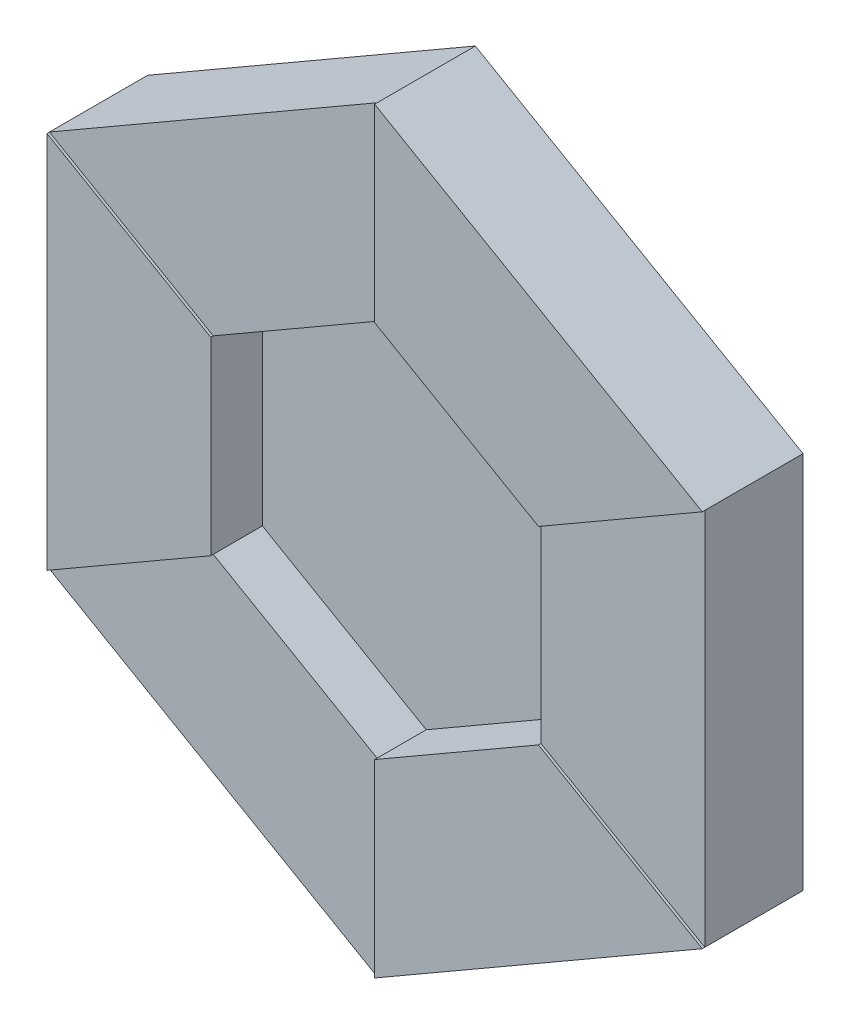
ISO-10303-21;
HEADER;
FILE_DESCRIPTION(('STEP AP214'),'2;1');
FILE_NAME('part.step','',(''),(''),'','','');
FILE_SCHEMA(('AUTOMOTIVE_DESIGN { 1 0 10303 214 1 1 1 1 }'));
ENDSEC;
DATA;
#1=APPLICATION_CONTEXT('core data for automotive mechanical design processes');
#2=APPLICATION_PROTOCOL_DEFINITION('international standard','automotive_design',2000,#1);
#3=PRODUCT_CONTEXT('',#1,'mechanical');
#4=PRODUCT('Part','Part','',(#3));
#5=PRODUCT_RELATED_PRODUCT_CATEGORY('part','',(#4));
#6=PRODUCT_DEFINITION_FORMATION('','',#4);
#7=PRODUCT_DEFINITION_CONTEXT('part definition',#1,'design');
#8=PRODUCT_DEFINITION('design','',#6,#7);
#9=PRODUCT_DEFINITION_SHAPE('','',#8);
#10=(LENGTH_UNIT() NAMED_UNIT(*) SI_UNIT(.MILLI.,.METRE.));
#11=(NAMED_UNIT(*) PLANE_ANGLE_UNIT() SI_UNIT($,.RADIAN.));
#12=(NAMED_UNIT(*) SI_UNIT($,.STERADIAN.) SOLID_ANGLE_UNIT());
#13=UNCERTAINTY_MEASURE_WITH_UNIT(LENGTH_MEASURE(1.E-05),#10,'distance_accuracy_value','');
#14=(GEOMETRIC_REPRESENTATION_CONTEXT(3) GLOBAL_UNCERTAINTY_ASSIGNED_CONTEXT((#13)) GLOBAL_UNIT_ASSIGNED_CONTEXT((#10,
#11,#12)) REPRESENTATION_CONTEXT('',''));
#15=CARTESIAN_POINT('',(0.,0.,0.));
#16=DIRECTION('',(0.,0.,1.));
#17=DIRECTION('',(1.,0.,0.));
#18=AXIS2_PLACEMENT_3D('',#15,#16,#17);
#19=CARTESIAN_POINT('',(200.,115.470053837925,0.));
#20=DIRECTION('',(0.,0.,1.));
#21=DIRECTION('',(1.,0.,0.));
#22=AXIS2_PLACEMENT_3D('',#19,#20,#21);
#23=PLANE('',#22);
#24=DIRECTION('',(-0.866025403784443,0.499999999999992,0.));
#25=VECTOR('',#24,1.);
#26=CARTESIAN_POINT('',(1.20736753927986E-12,-115.470053837925,0.));
#27=LINE('',#26,#25);
#28=CARTESIAN_POINT('',(1.20736753927986E-12,-115.470053837925,0.));
#29=VERTEX_POINT('',#28);
#30=CARTESIAN_POINT('',(-99.9999999999996,-57.7350269189634,0.));
#31=VERTEX_POINT('',#30);
#32=EDGE_CURVE('E210',#29,#31,#27,.T.);
#33=ORIENTED_EDGE('',*,*,#32,.F.);
#34=DIRECTION('',(0.866025403784433,0.50000000000001,0.));
#35=VECTOR('',#34,1.);
#36=CARTESIAN_POINT('',(250.,28.8675134594843,0.));
#37=LINE('',#36,#35);
#38=CARTESIAN_POINT('',(100.,-57.7350269189618,0.));
#39=VERTEX_POINT('',#38);
#40=EDGE_CURVE('E265',#29,#39,#37,.T.);
#41=ORIENTED_EDGE('',*,*,#40,.T.);
#42=DIRECTION('',(0.,-1.,0.));
#43=VECTOR('',#42,1.);
#44=CARTESIAN_POINT('',(100.,57.7350269189627,0.));
#45=LINE('',#44,#43);
#46=CARTESIAN_POINT('',(100.,57.7350269189627,0.));
#47=VERTEX_POINT('',#46);
#48=EDGE_CURVE('E288',#47,#39,#45,.T.);
#49=ORIENTED_EDGE('',*,*,#48,.F.);
#50=DIRECTION('',(0.86602540378444,-0.499999999999998,0.));
#51=VECTOR('',#50,1.);
#52=CARTESIAN_POINT('',(-4.02455846426619E-13,115.470053837925,0.));
#53=LINE('',#52,#51);
#54=CARTESIAN_POINT('',(-4.02455846426619E-13,115.470053837925,0.));
#55=VERTEX_POINT('',#54);
#56=EDGE_CURVE('E292',#55,#47,#53,.T.);
#57=ORIENTED_EDGE('',*,*,#56,.F.);
#58=DIRECTION('',(0.866025403784436,0.500000000000004,0.));
#59=VECTOR('',#58,1.);
#60=CARTESIAN_POINT('',(-100.,57.7350269189621,0.));
#61=LINE('',#60,#59);
#62=CARTESIAN_POINT('',(-100.,57.7350269189621,0.));
#63=VERTEX_POINT('',#62);
#64=EDGE_CURVE('E263',#63,#55,#61,.T.);
#65=ORIENTED_EDGE('',*,*,#64,.F.);
#66=DIRECTION('',(0.,-1.,0.));
#67=VECTOR('',#66,1.);
#68=CARTESIAN_POINT('',(-100.000000000001,115.470053837923,0.));
#69=LINE('',#68,#67);
#70=EDGE_CURVE('E11',#63,#31,#69,.T.);
#71=ORIENTED_EDGE('',*,*,#70,.T.);
#72=EDGE_LOOP('',(#33,#41,#49,#57,#65,#71));
#73=FACE_BOUND('',#72,.T.);
#74=ADVANCED_FACE('F43',(#73),#23,.T.);
#75=CARTESIAN_POINT('',(200.,115.470053837925,31.5));
#76=DIRECTION('',(-0.5,0.866025403784439,0.));
#77=DIRECTION('',(-0.866025403784439,-0.5,0.));
#78=AXIS2_PLACEMENT_3D('',#75,#76,#77);
#79=PLANE('',#78);
#80=DIRECTION('',(-0.866025403784438,-0.500000000000002,0.));
#81=VECTOR('',#80,1.);
#82=CARTESIAN_POINT('',(200.,115.470053837926,30.));
#83=LINE('',#82,#81);
#84=CARTESIAN_POINT('',(200.,115.470053837925,30.));
#85=VERTEX_POINT('',#84);
#86=CARTESIAN_POINT('',(100.,57.7350269189627,30.));
#87=VERTEX_POINT('',#86);
#88=EDGE_CURVE('E298',#85,#87,#83,.T.);
#89=ORIENTED_EDGE('',*,*,#88,.F.);
#90=DIRECTION('',(0.,0.,-1.));
#91=VECTOR('',#90,1.);
#92=CARTESIAN_POINT('',(200.,115.470053837925,31.5));
#93=LINE('',#92,#91);
#94=CARTESIAN_POINT('',(200.,115.470053837925,31.5));
#95=VERTEX_POINT('',#94);
#96=EDGE_CURVE('E53',#95,#85,#93,.T.);
#97=ORIENTED_EDGE('',*,*,#96,.F.);
#98=DIRECTION('',(0.866025403784439,0.5,0.));
#99=VECTOR('',#98,1.);
#100=CARTESIAN_POINT('',(200.,115.470053837925,31.5));
#101=LINE('',#100,#99);
#102=CARTESIAN_POINT('',(100.,57.7350269189627,31.5));
#103=VERTEX_POINT('',#102);
#104=EDGE_CURVE('E323',#103,#95,#101,.T.);
#105=ORIENTED_EDGE('',*,*,#104,.F.);
#106=DIRECTION('',(0.,0.,-1.));
#107=VECTOR('',#106,1.);
#108=CARTESIAN_POINT('',(100.,57.7350269189627,31.5));
#109=LINE('',#108,#107);
#110=EDGE_CURVE('E314',#103,#87,#109,.T.);
#111=ORIENTED_EDGE('',*,*,#110,.T.);
#112=EDGE_LOOP('',(#89,#97,#105,#111));
#113=FACE_BOUND('',#112,.T.);
#114=ADVANCED_FACE('F370',(#113),#79,.F.);
#115=CARTESIAN_POINT('',(200.,115.470053837925,31.5));
#116=DIRECTION('',(-0.499999999999998,-0.86602540378444,0.));
#117=DIRECTION('',(0.,0.,1.));
#118=AXIS2_PLACEMENT_3D('',#115,#116,#117);
#119=PLANE('',#118);
#120=ORIENTED_EDGE('',*,*,#96,.T.);
#121=CARTESIAN_POINT('',(200.,115.470053837925,-30.));
#122=VERTEX_POINT('',#121);
#123=EDGE_CURVE('E61',#85,#122,#93,.T.);
#124=ORIENTED_EDGE('',*,*,#123,.T.);
#125=DIRECTION('',(0.866025403784439,-0.499999999999999,0.));
#126=VECTOR('',#125,1.);
#127=CARTESIAN_POINT('',(200.,115.470053837925,-30.));
#128=LINE('',#127,#126);
#129=CARTESIAN_POINT('',(-6.80011602582908E-13,230.940107675851,-30.));
#130=VERTEX_POINT('',#129);
#131=EDGE_CURVE('E277',#130,#122,#128,.T.);
#132=ORIENTED_EDGE('',*,*,#131,.F.);
#133=DIRECTION('',(0.,0.,1.));
#134=VECTOR('',#133,1.);
#135=CARTESIAN_POINT('',(-6.80011602582908E-13,230.940107675851,-30.));
#136=LINE('',#135,#134);
#137=CARTESIAN_POINT('',(-6.80011602582908E-13,230.940107675851,30.));
#138=VERTEX_POINT('',#137);
#139=EDGE_CURVE('E280',#130,#138,#136,.T.);
#140=ORIENTED_EDGE('',*,*,#139,.T.);
#141=DIRECTION('',(0.,0.,-1.));
#142=VECTOR('',#141,1.);
#143=CARTESIAN_POINT('',(-9.29811783123569E-13,230.940107675851,31.5));
#144=LINE('',#143,#142);
#145=CARTESIAN_POINT('',(-9.29811783123569E-13,230.940107675851,31.5));
#146=VERTEX_POINT('',#145);
#147=EDGE_CURVE('E337',#146,#138,#144,.T.);
#148=ORIENTED_EDGE('',*,*,#147,.F.);
#149=DIRECTION('',(-0.86602540378444,0.499999999999998,0.));
#150=VECTOR('',#149,1.);
#151=CARTESIAN_POINT('',(200.,115.470053837925,31.5));
#152=LINE('',#151,#150);
#153=EDGE_CURVE('E333',#95,#146,#152,.T.);
#154=ORIENTED_EDGE('',*,*,#153,.F.);
#155=EDGE_LOOP('',(#120,#124,#132,#140,#148,#154));
#156=FACE_BOUND('',#155,.T.);
#157=ADVANCED_FACE('F347',(#156),#119,.F.);
#158=CARTESIAN_POINT('',(-9.29811783123569E-13,230.940107675851,31.5));
#159=DIRECTION('',(1.,0.,0.));
#160=DIRECTION('',(0.,1.,0.));
#161=AXIS2_PLACEMENT_3D('',#158,#159,#160);
#162=PLANE('',#161);
#163=ORIENTED_EDGE('',*,*,#147,.T.);
#164=DIRECTION('',(0.,1.,0.));
#165=VECTOR('',#164,1.);
#166=CARTESIAN_POINT('',(-6.80011602582908E-13,230.940107675851,30.));
#167=LINE('',#166,#165);
#168=CARTESIAN_POINT('',(-4.02455846426619E-13,115.470053837925,30.));
#169=VERTEX_POINT('',#168);
#170=EDGE_CURVE('E260',#169,#138,#167,.T.);
#171=ORIENTED_EDGE('',*,*,#170,.F.);
#172=DIRECTION('',(0.,0.,-1.));
#173=VECTOR('',#172,1.);
#174=CARTESIAN_POINT('',(-4.02455846426619E-13,115.470053837925,31.5));
#175=LINE('',#174,#173);
#176=CARTESIAN_POINT('',(-4.02455846426619E-13,115.470053837925,31.5));
#177=VERTEX_POINT('',#176);
#178=EDGE_CURVE('E334',#177,#169,#175,.T.);
#179=ORIENTED_EDGE('',*,*,#178,.F.);
#180=DIRECTION('',(0.,-1.,0.));
#181=VECTOR('',#180,1.);
#182=CARTESIAN_POINT('',(-9.29811783123569E-13,230.940107675851,31.5));
#183=LINE('',#182,#181);
#184=EDGE_CURVE('E331',#146,#177,#183,.T.);
#185=ORIENTED_EDGE('',*,*,#184,.F.);
#186=EDGE_LOOP('',(#163,#171,#179,#185));
#187=FACE_BOUND('',#186,.T.);
#188=ADVANCED_FACE('F367',(#187),#162,.F.);
#189=CARTESIAN_POINT('',(-4.02455846426619E-13,115.470053837925,31.5));
#190=DIRECTION('',(0.499999999999998,0.86602540378444,0.));
#191=DIRECTION('',(0.,0.,-1.));
#192=AXIS2_PLACEMENT_3D('',#189,#190,#191);
#193=PLANE('',#192);
#194=ORIENTED_EDGE('',*,*,#178,.T.);
#195=DIRECTION('',(0.,0.,-1.));
#196=VECTOR('',#195,1.);
#197=CARTESIAN_POINT('',(-4.02455846426619E-13,115.470053837925,30.));
#198=LINE('',#197,#196);
#199=EDGE_CURVE('E235',#169,#55,#198,.T.);
#200=ORIENTED_EDGE('',*,*,#199,.T.);
#201=ORIENTED_EDGE('',*,*,#56,.T.);
#202=DIRECTION('',(0.,0.,-1.));
#203=VECTOR('',#202,1.);
#204=CARTESIAN_POINT('',(100.,57.7350269189627,30.));
#205=LINE('',#204,#203);
#206=EDGE_CURVE('E307',#87,#47,#205,.T.);
#207=ORIENTED_EDGE('',*,*,#206,.F.);
#208=ORIENTED_EDGE('',*,*,#110,.F.);
#209=DIRECTION('',(0.86602540378444,-0.499999999999998,0.));
#210=VECTOR('',#209,1.);
#211=CARTESIAN_POINT('',(-4.02455846426619E-13,115.470053837925,31.5));
#212=LINE('',#211,#210);
#213=EDGE_CURVE('E69',#177,#103,#212,.T.);
#214=ORIENTED_EDGE('',*,*,#213,.F.);
#215=EDGE_LOOP('',(#194,#200,#201,#207,#208,#214));
#216=FACE_BOUND('',#215,.T.);
#217=ADVANCED_FACE('F407',(#216),#193,.F.);
#218=CARTESIAN_POINT('',(100.,57.7350269189627,31.5));
#219=DIRECTION('',(0.,0.,1.));
#220=DIRECTION('',(0.499999999999998,0.86602540378444,0.));
#221=AXIS2_PLACEMENT_3D('',#218,#219,#220);
#222=PLANE('',#221);
#223=ORIENTED_EDGE('',*,*,#104,.T.);
#224=ORIENTED_EDGE('',*,*,#153,.T.);
#225=ORIENTED_EDGE('',*,*,#184,.T.);
#226=ORIENTED_EDGE('',*,*,#213,.T.);
#227=EDGE_LOOP('',(#223,#224,#225,#226));
#228=FACE_BOUND('',#227,.T.);
#229=ADVANCED_FACE('F45',(#228),#222,.T.);
#230=CARTESIAN_POINT('',(200.,-115.470053837926,30.));
#231=DIRECTION('',(-1.,0.,0.));
#232=DIRECTION('',(0.,0.,1.));
#233=AXIS2_PLACEMENT_3D('',#230,#231,#232);
#234=PLANE('',#233);
#235=DIRECTION('',(0.,0.,-1.));
#236=VECTOR('',#235,1.);
#237=CARTESIAN_POINT('',(200.,-115.470053837926,30.));
#238=LINE('',#237,#236);
#239=CARTESIAN_POINT('',(200.000000000002,-115.470053837923,30.));
#240=VERTEX_POINT('',#239);
#241=CARTESIAN_POINT('',(200.,-115.470053837926,-30.));
#242=VERTEX_POINT('',#241);
#243=EDGE_CURVE('E310',#240,#242,#238,.T.);
#244=ORIENTED_EDGE('',*,*,#243,.T.);
#245=DIRECTION('',(0.,-1.,0.));
#246=VECTOR('',#245,1.);
#247=CARTESIAN_POINT('',(200.,-115.470053837926,-30.));
#248=LINE('',#247,#246);
#249=EDGE_CURVE('E217',#122,#242,#248,.T.);
#250=ORIENTED_EDGE('',*,*,#249,.F.);
#251=ORIENTED_EDGE('',*,*,#123,.F.);
#252=DIRECTION('',(0.,1.,0.));
#253=VECTOR('',#252,1.);
#254=CARTESIAN_POINT('',(200.,-115.470053837926,30.));
#255=LINE('',#254,#253);
#256=EDGE_CURVE('E295',#240,#85,#255,.T.);
#257=ORIENTED_EDGE('',*,*,#256,.F.);
#258=EDGE_LOOP('',(#244,#250,#251,#257));
#259=FACE_BOUND('',#258,.T.);
#260=ADVANCED_FACE('F353',(#259),#234,.F.);
#261=CARTESIAN_POINT('',(100.,57.7350269189627,30.));
#262=DIRECTION('',(1.,0.,0.));
#263=DIRECTION('',(0.,0.,-1.));
#264=AXIS2_PLACEMENT_3D('',#261,#262,#263);
#265=PLANE('',#264);
#266=ORIENTED_EDGE('',*,*,#48,.T.);
#267=DIRECTION('',(0.,0.,-1.));
#268=VECTOR('',#267,1.);
#269=CARTESIAN_POINT('',(100.,-57.7350269189627,30.));
#270=LINE('',#269,#268);
#271=CARTESIAN_POINT('',(100.000000000001,-57.7350269189614,30.));
#272=VERTEX_POINT('',#271);
#273=EDGE_CURVE('E304',#272,#39,#270,.T.);
#274=ORIENTED_EDGE('',*,*,#273,.F.);
#275=DIRECTION('',(0.,-1.,0.));
#276=VECTOR('',#275,1.);
#277=CARTESIAN_POINT('',(100.,57.7350269189627,30.));
#278=LINE('',#277,#276);
#279=EDGE_CURVE('E301',#87,#272,#278,.T.);
#280=ORIENTED_EDGE('',*,*,#279,.F.);
#281=ORIENTED_EDGE('',*,*,#206,.T.);
#282=EDGE_LOOP('',(#266,#274,#280,#281));
#283=FACE_BOUND('',#282,.T.);
#284=ADVANCED_FACE('F377',(#283),#265,.F.);
#285=CARTESIAN_POINT('',(100.,-57.7350269189628,30.));
#286=DIRECTION('',(0.,0.,1.));
#287=DIRECTION('',(1.,0.,0.));
#288=AXIS2_PLACEMENT_3D('',#285,#286,#287);
#289=PLANE('',#288);
#290=DIRECTION('',(0.866025403784438,-0.500000000000002,0.));
#291=VECTOR('',#290,1.);
#292=CARTESIAN_POINT('',(200.,-115.470053837926,30.));
#293=LINE('',#292,#291);
#294=EDGE_CURVE('E291',#272,#240,#293,.T.);
#295=ORIENTED_EDGE('',*,*,#294,.T.);
#296=ORIENTED_EDGE('',*,*,#256,.T.);
#297=ORIENTED_EDGE('',*,*,#88,.T.);
#298=ORIENTED_EDGE('',*,*,#279,.T.);
#299=EDGE_LOOP('',(#295,#296,#297,#298));
#300=FACE_BOUND('',#299,.T.);
#301=ADVANCED_FACE('F374',(#300),#289,.T.);
#302=CARTESIAN_POINT('',(2.3037127760972E-12,-230.940107675851,-30.));
#303=DIRECTION('',(-0.500000000000004,0.866025403784436,0.));
#304=DIRECTION('',(-0.866025403784437,-0.500000000000004,0.));
#305=AXIS2_PLACEMENT_3D('',#302,#303,#304);
#306=PLANE('',#305);
#307=DIRECTION('',(0.,0.,-1.));
#308=VECTOR('',#307,1.);
#309=CARTESIAN_POINT('',(2.3037127760972E-12,-230.940107675851,31.5));
#310=LINE('',#309,#308);
#311=CARTESIAN_POINT('',(2.3037127760972E-12,-230.940107675851,31.5));
#312=VERTEX_POINT('',#311);
#313=CARTESIAN_POINT('',(2.3037127760972E-12,-230.940107675851,30.));
#314=VERTEX_POINT('',#313);
#315=EDGE_CURVE('E391',#312,#314,#310,.T.);
#316=ORIENTED_EDGE('',*,*,#315,.T.);
#317=DIRECTION('',(0.,0.,1.));
#318=VECTOR('',#317,1.);
#319=CARTESIAN_POINT('',(2.3037127760972E-12,-230.940107675851,-30.));
#320=LINE('',#319,#318);
#321=CARTESIAN_POINT('',(2.3037127760972E-12,-230.940107675851,-30.));
#322=VERTEX_POINT('',#321);
#323=EDGE_CURVE('E47',#322,#314,#320,.T.);
#324=ORIENTED_EDGE('',*,*,#323,.F.);
#325=DIRECTION('',(-0.866025403784437,-0.500000000000004,0.));
#326=VECTOR('',#325,1.);
#327=CARTESIAN_POINT('',(2.3037127760972E-12,-230.940107675851,-30.));
#328=LINE('',#327,#326);
#329=EDGE_CURVE('E270',#242,#322,#328,.T.);
#330=ORIENTED_EDGE('',*,*,#329,.F.);
#331=ORIENTED_EDGE('',*,*,#243,.F.);
#332=DIRECTION('',(0.,0.,-1.));
#333=VECTOR('',#332,1.);
#334=CARTESIAN_POINT('',(200.000000000002,-115.470053837923,31.5));
#335=LINE('',#334,#333);
#336=CARTESIAN_POINT('',(200.000000000002,-115.470053837923,31.5));
#337=VERTEX_POINT('',#336);
#338=EDGE_CURVE('E393',#337,#240,#335,.T.);
#339=ORIENTED_EDGE('',*,*,#338,.F.);
#340=DIRECTION('',(0.866025403784433,0.50000000000001,0.));
#341=VECTOR('',#340,1.);
#342=CARTESIAN_POINT('',(2.3037127760972E-12,-230.940107675851,31.5));
#343=LINE('',#342,#341);
#344=EDGE_CURVE('E691',#312,#337,#343,.T.);
#345=ORIENTED_EDGE('',*,*,#344,.F.);
#346=EDGE_LOOP('',(#316,#324,#330,#331,#339,#345));
#347=FACE_BOUND('',#346,.T.);
#348=ADVANCED_FACE('F360',(#347),#306,.F.);
#349=CARTESIAN_POINT('',(-199.999999999999,-115.470053837927,-30.));
#350=DIRECTION('',(0.499999999999992,0.866025403784443,0.));
#351=DIRECTION('',(-0.866025403784443,0.499999999999992,0.));
#352=AXIS2_PLACEMENT_3D('',#349,#350,#351);
#353=PLANE('',#352);
#354=ORIENTED_EDGE('',*,*,#323,.T.);
#355=DIRECTION('',(0.866025403784443,-0.499999999999992,0.));
#356=VECTOR('',#355,1.);
#357=CARTESIAN_POINT('',(-199.999999999999,-115.470053837927,30.));
#358=LINE('',#357,#356);
#359=CARTESIAN_POINT('',(-199.999999999999,-115.470053837927,30.));
#360=VERTEX_POINT('',#359);
#361=EDGE_CURVE('E190',#360,#314,#358,.T.);
#362=ORIENTED_EDGE('',*,*,#361,.F.);
#363=DIRECTION('',(0.,0.,1.));
#364=VECTOR('',#363,1.);
#365=CARTESIAN_POINT('',(-199.999999999999,-115.470053837927,-30.));
#366=LINE('',#365,#364);
#367=CARTESIAN_POINT('',(-199.999999999999,-115.470053837927,-30.));
#368=VERTEX_POINT('',#367);
#369=EDGE_CURVE('E176',#368,#360,#366,.T.);
#370=ORIENTED_EDGE('',*,*,#369,.F.);
#371=DIRECTION('',(-0.866025403784443,0.499999999999992,0.));
#372=VECTOR('',#371,1.);
#373=CARTESIAN_POINT('',(-199.999999999999,-115.470053837927,-30.));
#374=LINE('',#373,#372);
#375=EDGE_CURVE('E272',#322,#368,#374,.T.);
#376=ORIENTED_EDGE('',*,*,#375,.F.);
#377=EDGE_LOOP('',(#354,#362,#370,#376));
#378=FACE_BOUND('',#377,.T.);
#379=ADVANCED_FACE('F192',(#378),#353,.F.);
#380=CARTESIAN_POINT('',(-200.000000000001,115.470053837924,-30.));
#381=DIRECTION('',(1.,0.,0.));
#382=DIRECTION('',(0.,1.,0.));
#383=AXIS2_PLACEMENT_3D('',#380,#381,#382);
#384=PLANE('',#383);
#385=DIRECTION('',(0.,0.,-1.));
#386=VECTOR('',#385,1.);
#387=CARTESIAN_POINT('',(-200.000000000001,115.470053837924,31.5));
#388=LINE('',#387,#386);
#389=CARTESIAN_POINT('',(-200.000000000001,115.470053837924,31.5));
#390=VERTEX_POINT('',#389);
#391=CARTESIAN_POINT('',(-200.000000000001,115.470053837924,30.));
#392=VERTEX_POINT('',#391);
#393=EDGE_CURVE('E214',#390,#392,#388,.T.);
#394=ORIENTED_EDGE('',*,*,#393,.T.);
#395=DIRECTION('',(0.,0.,1.));
#396=VECTOR('',#395,1.);
#397=CARTESIAN_POINT('',(-200.000000000001,115.470053837924,-30.));
#398=LINE('',#397,#396);
#399=CARTESIAN_POINT('',(-200.000000000001,115.470053837924,-30.));
#400=VERTEX_POINT('',#399);
#401=EDGE_CURVE('E187',#400,#392,#398,.T.);
#402=ORIENTED_EDGE('',*,*,#401,.F.);
#403=DIRECTION('',(0.,1.,0.));
#404=VECTOR('',#403,1.);
#405=CARTESIAN_POINT('',(-200.000000000001,115.470053837924,-30.));
#406=LINE('',#405,#404);
#407=EDGE_CURVE('E184',#368,#400,#406,.T.);
#408=ORIENTED_EDGE('',*,*,#407,.F.);
#409=ORIENTED_EDGE('',*,*,#369,.T.);
#410=DIRECTION('',(0.,0.,-1.));
#411=VECTOR('',#410,1.);
#412=CARTESIAN_POINT('',(-199.999999999999,-115.470053837927,31.5));
#413=LINE('',#412,#411);
#414=CARTESIAN_POINT('',(-199.999999999999,-115.470053837927,31.5));
#415=VERTEX_POINT('',#414);
#416=EDGE_CURVE('E181',#415,#360,#413,.T.);
#417=ORIENTED_EDGE('',*,*,#416,.F.);
#418=DIRECTION('',(0.,-1.,0.));
#419=VECTOR('',#418,1.);
#420=CARTESIAN_POINT('',(-200.000000000001,115.470053837924,31.5));
#421=LINE('',#420,#419);
#422=EDGE_CURVE('E225',#390,#415,#421,.T.);
#423=ORIENTED_EDGE('',*,*,#422,.F.);
#424=EDGE_LOOP('',(#394,#402,#408,#409,#417,#423));
#425=FACE_BOUND('',#424,.T.);
#426=ADVANCED_FACE('F179',(#425),#384,.F.);
#427=CARTESIAN_POINT('',(-6.80011602582908E-13,230.940107675851,-30.));
#428=DIRECTION('',(0.500000000000004,-0.866025403784436,0.));
#429=DIRECTION('',(0.866025403784437,0.500000000000004,0.));
#430=AXIS2_PLACEMENT_3D('',#427,#428,#429);
#431=PLANE('',#430);
#432=ORIENTED_EDGE('',*,*,#401,.T.);
#433=DIRECTION('',(-0.866025403784436,-0.500000000000004,0.));
#434=VECTOR('',#433,1.);
#435=CARTESIAN_POINT('',(-6.80011602582908E-13,230.940107675851,30.));
#436=LINE('',#435,#434);
#437=EDGE_CURVE('E257',#138,#392,#436,.T.);
#438=ORIENTED_EDGE('',*,*,#437,.F.);
#439=ORIENTED_EDGE('',*,*,#139,.F.);
#440=DIRECTION('',(0.866025403784436,0.500000000000004,0.));
#441=VECTOR('',#440,1.);
#442=CARTESIAN_POINT('',(-6.80011602582908E-13,230.940107675851,-30.));
#443=LINE('',#442,#441);
#444=EDGE_CURVE('E275',#400,#130,#443,.T.);
#445=ORIENTED_EDGE('',*,*,#444,.F.);
#446=EDGE_LOOP('',(#432,#438,#439,#445));
#447=FACE_BOUND('',#446,.T.);
#448=ADVANCED_FACE('F364',(#447),#431,.F.);
#449=CARTESIAN_POINT('',(200.,115.470053837925,-30.));
#450=DIRECTION('',(0.,0.,1.));
#451=DIRECTION('',(1.,0.,0.));
#452=AXIS2_PLACEMENT_3D('',#449,#450,#451);
#453=PLANE('',#452);
#454=ORIENTED_EDGE('',*,*,#249,.T.);
#455=ORIENTED_EDGE('',*,*,#329,.T.);
#456=ORIENTED_EDGE('',*,*,#375,.T.);
#457=ORIENTED_EDGE('',*,*,#407,.T.);
#458=ORIENTED_EDGE('',*,*,#444,.T.);
#459=ORIENTED_EDGE('',*,*,#131,.T.);
#460=EDGE_LOOP('',(#454,#455,#456,#457,#458,#459));
#461=FACE_BOUND('',#460,.T.);
#462=ADVANCED_FACE('F350',(#461),#453,.F.);
#463=CARTESIAN_POINT('',(-200.000000000001,115.470053837924,31.5));
#464=DIRECTION('',(-0.499999999999996,-0.866025403784441,0.));
#465=DIRECTION('',(0.866025403784441,-0.499999999999996,0.));
#466=AXIS2_PLACEMENT_3D('',#463,#464,#465);
#467=PLANE('',#466);
#468=DIRECTION('',(0.866025403784442,-0.499999999999994,0.));
#469=VECTOR('',#468,1.);
#470=CARTESIAN_POINT('',(-200.000000000001,115.470053837924,30.));
#471=LINE('',#470,#469);
#472=CARTESIAN_POINT('',(-100.,57.7350269189621,30.));
#473=VERTEX_POINT('',#472);
#474=EDGE_CURVE('E251',#392,#473,#471,.T.);
#475=ORIENTED_EDGE('',*,*,#474,.F.);
#476=ORIENTED_EDGE('',*,*,#393,.F.);
#477=DIRECTION('',(-0.866025403784441,0.499999999999996,0.));
#478=VECTOR('',#477,1.);
#479=CARTESIAN_POINT('',(-200.000000000001,115.470053837924,31.5));
#480=LINE('',#479,#478);
#481=CARTESIAN_POINT('',(-100.,57.7350269189621,31.5));
#482=VERTEX_POINT('',#481);
#483=EDGE_CURVE('E226',#482,#390,#480,.T.);
#484=ORIENTED_EDGE('',*,*,#483,.F.);
#485=DIRECTION('',(0.,0.,-1.));
#486=VECTOR('',#485,1.);
#487=CARTESIAN_POINT('',(-100.,57.7350269189621,31.5));
#488=LINE('',#487,#486);
#489=EDGE_CURVE('E219',#482,#473,#488,.T.);
#490=ORIENTED_EDGE('',*,*,#489,.T.);
#491=EDGE_LOOP('',(#475,#476,#484,#490));
#492=FACE_BOUND('',#491,.T.);
#493=ADVANCED_FACE('F492',(#492),#467,.F.);
#494=CARTESIAN_POINT('',(-199.999999999999,-115.470053837927,31.5));
#495=DIRECTION('',(-0.500000000000008,0.866025403784434,0.));
#496=DIRECTION('',(-0.866025403784434,-0.500000000000008,0.));
#497=AXIS2_PLACEMENT_3D('',#494,#495,#496);
#498=PLANE('',#497);
#499=ORIENTED_EDGE('',*,*,#416,.T.);
#500=DIRECTION('',(-0.866025403784435,-0.500000000000006,0.));
#501=VECTOR('',#500,1.);
#502=CARTESIAN_POINT('',(-199.999999999999,-115.470053837927,30.));
#503=LINE('',#502,#501);
#504=CARTESIAN_POINT('',(-99.9999999999996,-57.7350269189634,30.));
#505=VERTEX_POINT('',#504);
#506=EDGE_CURVE('E199',#505,#360,#503,.T.);
#507=ORIENTED_EDGE('',*,*,#506,.F.);
#508=DIRECTION('',(0.,0.,-1.));
#509=VECTOR('',#508,1.);
#510=CARTESIAN_POINT('',(-99.9999999999996,-57.7350269189634,31.5));
#511=LINE('',#510,#509);
#512=CARTESIAN_POINT('',(-99.9999999999996,-57.7350269189634,31.5));
#513=VERTEX_POINT('',#512);
#514=EDGE_CURVE('E215',#513,#505,#511,.T.);
#515=ORIENTED_EDGE('',*,*,#514,.F.);
#516=DIRECTION('',(0.866025403784434,0.500000000000008,0.));
#517=VECTOR('',#516,1.);
#518=CARTESIAN_POINT('',(-199.999999999999,-115.470053837927,31.5));
#519=LINE('',#518,#517);
#520=EDGE_CURVE('E213',#415,#513,#519,.T.);
#521=ORIENTED_EDGE('',*,*,#520,.F.);
#522=EDGE_LOOP('',(#499,#507,#515,#521));
#523=FACE_BOUND('',#522,.T.);
#524=ADVANCED_FACE('F212',(#523),#498,.F.);
#525=CARTESIAN_POINT('',(-99.9999999999996,-57.7350269189634,31.5));
#526=DIRECTION('',(-1.,0.,0.));
#527=DIRECTION('',(0.,0.,-1.));
#528=AXIS2_PLACEMENT_3D('',#525,#526,#527);
#529=PLANE('',#528);
#530=ORIENTED_EDGE('',*,*,#70,.F.);
#531=DIRECTION('',(0.,0.,-1.));
#532=VECTOR('',#531,1.);
#533=CARTESIAN_POINT('',(-100.,57.7350269189621,30.));
#534=LINE('',#533,#532);
#535=EDGE_CURVE('E238',#473,#63,#534,.T.);
#536=ORIENTED_EDGE('',*,*,#535,.F.);
#537=ORIENTED_EDGE('',*,*,#489,.F.);
#538=DIRECTION('',(0.,1.,0.));
#539=VECTOR('',#538,1.);
#540=CARTESIAN_POINT('',(-99.9999999999996,-57.7350269189634,31.5));
#541=LINE('',#540,#539);
#542=EDGE_CURVE('E229',#513,#482,#541,.T.);
#543=ORIENTED_EDGE('',*,*,#542,.F.);
#544=ORIENTED_EDGE('',*,*,#514,.T.);
#545=DIRECTION('',(0.,0.,-1.));
#546=VECTOR('',#545,1.);
#547=CARTESIAN_POINT('',(-99.9999999999996,-57.7350269189634,30.));
#548=LINE('',#547,#546);
#549=EDGE_CURVE('E668',#505,#31,#548,.T.);
#550=ORIENTED_EDGE('',*,*,#549,.T.);
#551=EDGE_LOOP('',(#530,#536,#537,#543,#544,#550));
#552=FACE_BOUND('',#551,.T.);
#553=ADVANCED_FACE('F421',(#552),#529,.F.);
#554=CARTESIAN_POINT('',(-100.,57.7350269189621,31.5));
#555=DIRECTION('',(0.,0.,1.));
#556=DIRECTION('',(-1.,0.,0.));
#557=AXIS2_PLACEMENT_3D('',#554,#555,#556);
#558=PLANE('',#557);
#559=ORIENTED_EDGE('',*,*,#483,.T.);
#560=ORIENTED_EDGE('',*,*,#422,.T.);
#561=ORIENTED_EDGE('',*,*,#520,.T.);
#562=ORIENTED_EDGE('',*,*,#542,.T.);
#563=EDGE_LOOP('',(#559,#560,#561,#562));
#564=FACE_BOUND('',#563,.T.);
#565=ADVANCED_FACE('F413',(#564),#558,.T.);
#566=CARTESIAN_POINT('',(-100.,57.7350269189621,30.));
#567=DIRECTION('',(-0.500000000000004,0.866025403784436,0.));
#568=DIRECTION('',(0.,0.,-1.));
#569=AXIS2_PLACEMENT_3D('',#566,#567,#568);
#570=PLANE('',#569);
#571=ORIENTED_EDGE('',*,*,#64,.T.);
#572=ORIENTED_EDGE('',*,*,#199,.F.);
#573=DIRECTION('',(0.866025403784436,0.500000000000004,0.));
#574=VECTOR('',#573,1.);
#575=CARTESIAN_POINT('',(-100.,57.7350269189621,30.));
#576=LINE('',#575,#574);
#577=EDGE_CURVE('E249',#473,#169,#576,.T.);
#578=ORIENTED_EDGE('',*,*,#577,.F.);
#579=ORIENTED_EDGE('',*,*,#535,.T.);
#580=EDGE_LOOP('',(#571,#572,#578,#579));
#581=FACE_BOUND('',#580,.T.);
#582=ADVANCED_FACE('F411',(#581),#570,.F.);
#583=CARTESIAN_POINT('',(-3.88578058618805E-13,115.470053837925,30.));
#584=DIRECTION('',(0.,0.,1.));
#585=DIRECTION('',(-0.500000000000004,0.866025403784436,0.));
#586=AXIS2_PLACEMENT_3D('',#583,#584,#585);
#587=PLANE('',#586);
#588=ORIENTED_EDGE('',*,*,#170,.T.);
#589=ORIENTED_EDGE('',*,*,#437,.T.);
#590=ORIENTED_EDGE('',*,*,#474,.T.);
#591=ORIENTED_EDGE('',*,*,#577,.T.);
#592=EDGE_LOOP('',(#588,#589,#590,#591));
#593=FACE_BOUND('',#592,.T.);
#594=ADVANCED_FACE('F403',(#593),#587,.T.);
#595=CARTESIAN_POINT('',(2.3037127760972E-12,-230.940107675851,31.5));
#596=DIRECTION('',(1.,0.,0.));
#597=DIRECTION('',(0.,1.,0.));
#598=AXIS2_PLACEMENT_3D('',#595,#596,#597);
#599=PLANE('',#598);
#600=DIRECTION('',(0.,1.,0.));
#601=VECTOR('',#600,1.);
#602=CARTESIAN_POINT('',(2.52575738102223E-12,-230.940107675851,30.));
#603=LINE('',#602,#601);
#604=CARTESIAN_POINT('',(1.20736753927986E-12,-115.470053837925,30.));
#605=VERTEX_POINT('',#604);
#606=EDGE_CURVE('E198',#314,#605,#603,.T.);
#607=ORIENTED_EDGE('',*,*,#606,.F.);
#608=ORIENTED_EDGE('',*,*,#315,.F.);
#609=DIRECTION('',(0.,-1.,0.));
#610=VECTOR('',#609,1.);
#611=CARTESIAN_POINT('',(2.3037127760972E-12,-230.940107675851,31.5));
#612=LINE('',#611,#610);
#613=CARTESIAN_POINT('',(1.20736753927986E-12,-115.470053837925,31.5));
#614=VERTEX_POINT('',#613);
#615=EDGE_CURVE('E672',#614,#312,#612,.T.);
#616=ORIENTED_EDGE('',*,*,#615,.F.);
#617=DIRECTION('',(0.,0.,-1.));
#618=VECTOR('',#617,1.);
#619=CARTESIAN_POINT('',(1.20736753927986E-12,-115.470053837925,31.5));
#620=LINE('',#619,#618);
#621=EDGE_CURVE('E686',#614,#605,#620,.T.);
#622=ORIENTED_EDGE('',*,*,#621,.T.);
#623=EDGE_LOOP('',(#607,#608,#616,#622));
#624=FACE_BOUND('',#623,.T.);
#625=ADVANCED_FACE('F419',(#624),#599,.F.);
#626=CARTESIAN_POINT('',(200.000000000002,-115.470053837923,31.5));
#627=DIRECTION('',(-0.499999999999988,-0.866025403784445,0.));
#628=DIRECTION('',(0.866025403784445,-0.499999999999988,0.));
#629=AXIS2_PLACEMENT_3D('',#626,#627,#628);
#630=PLANE('',#629);
#631=ORIENTED_EDGE('',*,*,#294,.F.);
#632=DIRECTION('',(0.,0.,-1.));
#633=VECTOR('',#632,1.);
#634=CARTESIAN_POINT('',(100.000000000001,-57.7350269189614,31.5));
#635=LINE('',#634,#633);
#636=CARTESIAN_POINT('',(100.000000000001,-57.7350269189614,31.5));
#637=VERTEX_POINT('',#636);
#638=EDGE_CURVE('E386',#637,#272,#635,.T.);
#639=ORIENTED_EDGE('',*,*,#638,.F.);
#640=DIRECTION('',(-0.866025403784445,0.499999999999988,0.));
#641=VECTOR('',#640,1.);
#642=CARTESIAN_POINT('',(200.000000000002,-115.470053837923,31.5));
#643=LINE('',#642,#641);
#644=EDGE_CURVE('E693',#337,#637,#643,.T.);
#645=ORIENTED_EDGE('',*,*,#644,.F.);
#646=ORIENTED_EDGE('',*,*,#338,.T.);
#647=EDGE_LOOP('',(#631,#639,#645,#646));
#648=FACE_BOUND('',#647,.T.);
#649=ADVANCED_FACE('F537',(#648),#630,.F.);
#650=CARTESIAN_POINT('',(100.000000000001,-57.7350269189614,31.5));
#651=DIRECTION('',(0.50000000000001,-0.866025403784433,0.));
#652=DIRECTION('',(0.,0.,-1.));
#653=AXIS2_PLACEMENT_3D('',#650,#651,#652);
#654=PLANE('',#653);
#655=ORIENTED_EDGE('',*,*,#40,.F.);
#656=DIRECTION('',(0.,0.,-1.));
#657=VECTOR('',#656,1.);
#658=CARTESIAN_POINT('',(1.20736753927986E-12,-115.470053837925,30.));
#659=LINE('',#658,#657);
#660=EDGE_CURVE('E669',#605,#29,#659,.T.);
#661=ORIENTED_EDGE('',*,*,#660,.F.);
#662=ORIENTED_EDGE('',*,*,#621,.F.);
#663=DIRECTION('',(-0.866025403784433,-0.50000000000001,0.));
#664=VECTOR('',#663,1.);
#665=CARTESIAN_POINT('',(100.000000000001,-57.7350269189614,31.5));
#666=LINE('',#665,#664);
#667=EDGE_CURVE('E684',#637,#614,#666,.T.);
#668=ORIENTED_EDGE('',*,*,#667,.F.);
#669=ORIENTED_EDGE('',*,*,#638,.T.);
#670=ORIENTED_EDGE('',*,*,#273,.T.);
#671=EDGE_LOOP('',(#655,#661,#662,#668,#669,#670));
#672=FACE_BOUND('',#671,.T.);
#673=ADVANCED_FACE('F381',(#672),#654,.F.);
#674=CARTESIAN_POINT('',(1.20042864537595E-12,-115.470053837925,31.5));
#675=DIRECTION('',(0.,0.,1.));
#676=DIRECTION('',(0.50000000000001,-0.866025403784433,0.));
#677=AXIS2_PLACEMENT_3D('',#674,#675,#676);
#678=PLANE('',#677);
#679=ORIENTED_EDGE('',*,*,#615,.T.);
#680=ORIENTED_EDGE('',*,*,#344,.T.);
#681=ORIENTED_EDGE('',*,*,#644,.T.);
#682=ORIENTED_EDGE('',*,*,#667,.T.);
#683=EDGE_LOOP('',(#679,#680,#681,#682));
#684=FACE_BOUND('',#683,.T.);
#685=ADVANCED_FACE('F558',(#684),#678,.T.);
#686=CARTESIAN_POINT('',(1.20736753927986E-12,-115.470053837925,30.));
#687=DIRECTION('',(-0.499999999999992,-0.866025403784443,0.));
#688=DIRECTION('',(0.,0.,-1.));
#689=AXIS2_PLACEMENT_3D('',#686,#687,#688);
#690=PLANE('',#689);
#691=ORIENTED_EDGE('',*,*,#32,.T.);
#692=ORIENTED_EDGE('',*,*,#549,.F.);
#693=DIRECTION('',(-0.866025403784443,0.499999999999992,0.));
#694=VECTOR('',#693,1.);
#695=CARTESIAN_POINT('',(1.20736753927986E-12,-115.470053837925,30.));
#696=LINE('',#695,#694);
#697=EDGE_CURVE('E204',#605,#505,#696,.T.);
#698=ORIENTED_EDGE('',*,*,#697,.F.);
#699=ORIENTED_EDGE('',*,*,#660,.T.);
#700=EDGE_LOOP('',(#691,#692,#698,#699));
#701=FACE_BOUND('',#700,.T.);
#702=ADVANCED_FACE('F568',(#701),#690,.F.);
#703=CARTESIAN_POINT('',(-99.9999999999996,-57.7350269189634,30.));
#704=DIRECTION('',(0.,0.,1.));
#705=DIRECTION('',(-0.499999999999992,-0.866025403784443,0.));
#706=AXIS2_PLACEMENT_3D('',#703,#704,#705);
#707=PLANE('',#706);
#708=ORIENTED_EDGE('',*,*,#506,.T.);
#709=ORIENTED_EDGE('',*,*,#361,.T.);
#710=ORIENTED_EDGE('',*,*,#606,.T.);
#711=ORIENTED_EDGE('',*,*,#697,.T.);
#712=EDGE_LOOP('',(#708,#709,#710,#711));
#713=FACE_BOUND('',#712,.T.);
#714=ADVANCED_FACE('F202',(#713),#707,.T.);
#715=CLOSED_SHELL('',(#74,#114,#157,#188,#217,#229,#260,#284,#301,#348,#379,#426,#448,#462,#493,
#524,#553,#565,#582,#594,#625,#649,#673,#685,#702,#714));
#716=MANIFOLD_SOLID_BREP('B2',#715);
#717=ADVANCED_BREP_SHAPE_REPRESENTATION('',(#18,#716),#14);
#718=SHAPE_DEFINITION_REPRESENTATION(#9,#717);
ENDSEC;
END-ISO-10303-21;
